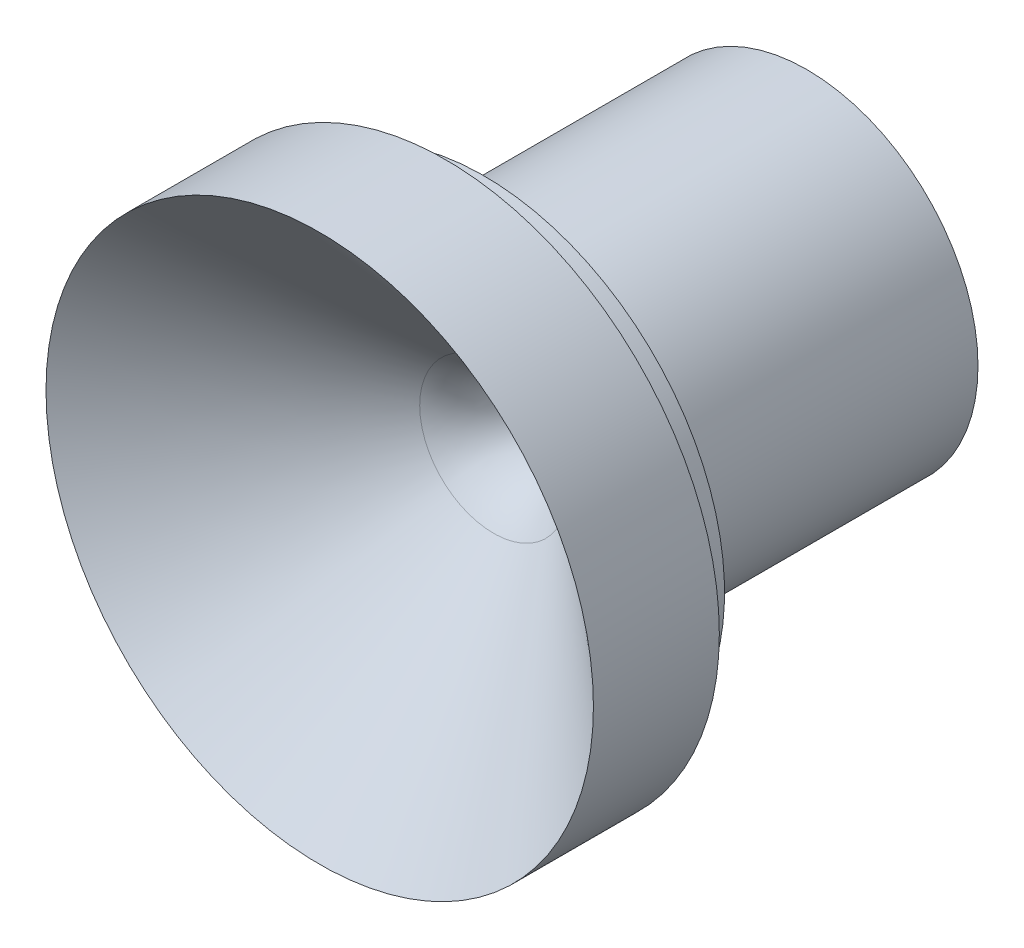
ISO-10303-21;
HEADER;
FILE_DESCRIPTION(('STEP AP214'),'2;1');
FILE_NAME('part.step','',(''),(''),'','','');
FILE_SCHEMA(('AUTOMOTIVE_DESIGN { 1 0 10303 214 1 1 1 1 }'));
ENDSEC;
DATA;
#1=APPLICATION_CONTEXT('core data for automotive mechanical design processes');
#2=APPLICATION_PROTOCOL_DEFINITION('international standard','automotive_design',2000,#1);
#3=PRODUCT_CONTEXT('',#1,'mechanical');
#4=PRODUCT('Part','Part','',(#3));
#5=PRODUCT_RELATED_PRODUCT_CATEGORY('part','',(#4));
#6=PRODUCT_DEFINITION_FORMATION('','',#4);
#7=PRODUCT_DEFINITION_CONTEXT('part definition',#1,'design');
#8=PRODUCT_DEFINITION('design','',#6,#7);
#9=PRODUCT_DEFINITION_SHAPE('','',#8);
#10=(LENGTH_UNIT() NAMED_UNIT(*) SI_UNIT(.MILLI.,.METRE.));
#11=(NAMED_UNIT(*) PLANE_ANGLE_UNIT() SI_UNIT($,.RADIAN.));
#12=(NAMED_UNIT(*) SI_UNIT($,.STERADIAN.) SOLID_ANGLE_UNIT());
#13=UNCERTAINTY_MEASURE_WITH_UNIT(LENGTH_MEASURE(1.E-05),#10,'distance_accuracy_value','');
#14=(GEOMETRIC_REPRESENTATION_CONTEXT(3) GLOBAL_UNCERTAINTY_ASSIGNED_CONTEXT((#13)) GLOBAL_UNIT_ASSIGNED_CONTEXT((#10,
#11,#12)) REPRESENTATION_CONTEXT('',''));
#15=CARTESIAN_POINT('',(0.,0.,0.));
#16=DIRECTION('',(0.,0.,1.));
#17=DIRECTION('',(1.,0.,0.));
#18=AXIS2_PLACEMENT_3D('',#15,#16,#17);
#19=CARTESIAN_POINT('',(0.,0.,0.));
#20=DIRECTION('',(0.,0.,-1.));
#21=DIRECTION('',(-1.,0.,0.));
#22=AXIS2_PLACEMENT_3D('',#19,#20,#21);
#23=TOROIDAL_SURFACE('',#22,6.5532,4.76250000000001);
#24=CARTESIAN_POINT('',(0.,0.,0.));
#25=DIRECTION('',(0.,0.,-1.));
#26=DIRECTION('',(-1.,0.,0.));
#27=AXIS2_PLACEMENT_3D('',#24,#25,#26);
#28=CIRCLE('',#27,1.7907);
#29=CARTESIAN_POINT('',(-1.7907,0.,0.));
#30=VERTEX_POINT('',#29);
#31=EDGE_CURVE('E10',#30,#30,#28,.T.);
#32=ORIENTED_EDGE('',*,*,#31,.T.);
#33=EDGE_LOOP('',(#32));
#34=FACE_BOUND('',#33,.T.);
#35=CARTESIAN_POINT('',(0.,0.,3.59315245126895));
#36=DIRECTION('',(0.,0.,-1.));
#37=DIRECTION('',(-1.,0.,0.));
#38=AXIS2_PLACEMENT_3D('',#35,#36,#37);
#39=CIRCLE('',#38,3.42739422997203);
#40=CARTESIAN_POINT('',(-3.42739422997203,0.,3.59315245126895));
#41=VERTEX_POINT('',#40);
#42=EDGE_CURVE('E74',#41,#41,#39,.T.);
#43=ORIENTED_EDGE('',*,*,#42,.F.);
#44=EDGE_LOOP('',(#43));
#45=FACE_BOUND('',#44,.T.);
#46=ADVANCED_FACE('F37',(#34,#45),#23,.T.);
#47=CARTESIAN_POINT('',(0.,0.,0.));
#48=DIRECTION('',(0.,0.,-1.));
#49=DIRECTION('',(-1.,0.,0.));
#50=AXIS2_PLACEMENT_3D('',#47,#48,#49);
#51=CYLINDRICAL_SURFACE('',#50,1.7907);
#52=CARTESIAN_POINT('',(0.,0.,-2.794));
#53=DIRECTION('',(0.,0.,-1.));
#54=DIRECTION('',(-1.,0.,0.));
#55=AXIS2_PLACEMENT_3D('',#52,#53,#54);
#56=CIRCLE('',#55,1.7907);
#57=CARTESIAN_POINT('',(-1.7907,0.,-2.794));
#58=VERTEX_POINT('',#57);
#59=EDGE_CURVE('E43',#58,#58,#56,.T.);
#60=ORIENTED_EDGE('',*,*,#59,.T.);
#61=EDGE_LOOP('',(#60));
#62=FACE_BOUND('',#61,.T.);
#63=ORIENTED_EDGE('',*,*,#31,.F.);
#64=EDGE_LOOP('',(#63));
#65=FACE_BOUND('',#64,.T.);
#66=ADVANCED_FACE('F82',(#62,#65),#51,.F.);
#67=CARTESIAN_POINT('',(0.,0.,-2.794));
#68=DIRECTION('',(0.,0.,-1.));
#69=DIRECTION('',(-1.,0.,0.));
#70=AXIS2_PLACEMENT_3D('',#67,#68,#69);
#71=CONICAL_SURFACE('',#70,1.7907,0.261799387799139);
#72=CARTESIAN_POINT('',(0.,0.,-10.9462917840538));
#73=DIRECTION('',(0.,0.,-1.));
#74=DIRECTION('',(-1.,0.,0.));
#75=AXIS2_PLACEMENT_3D('',#72,#73,#74);
#76=CIRCLE('',#75,3.9751);
#77=CARTESIAN_POINT('',(-3.9751,0.,-10.9462917840538));
#78=VERTEX_POINT('',#77);
#79=EDGE_CURVE('E47',#78,#78,#76,.T.);
#80=ORIENTED_EDGE('',*,*,#79,.T.);
#81=EDGE_LOOP('',(#80));
#82=FACE_BOUND('',#81,.T.);
#83=ORIENTED_EDGE('',*,*,#59,.F.);
#84=EDGE_LOOP('',(#83));
#85=FACE_BOUND('',#84,.T.);
#86=ADVANCED_FACE('F86',(#82,#85),#71,.F.);
#87=CARTESIAN_POINT('',(0.,3.9751,-10.9462917840538));
#88=DIRECTION('',(0.,0.,-1.));
#89=DIRECTION('',(-1.,0.,0.));
#90=AXIS2_PLACEMENT_3D('',#87,#88,#89);
#91=PLANE('',#90);
#92=CARTESIAN_POINT('',(0.,0.,-10.9462917840538));
#93=DIRECTION('',(0.,0.,-1.));
#94=DIRECTION('',(-1.,0.,0.));
#95=AXIS2_PLACEMENT_3D('',#92,#93,#94);
#96=CIRCLE('',#95,7.9375);
#97=CARTESIAN_POINT('',(-7.9375,0.,-10.9462917840538));
#98=VERTEX_POINT('',#97);
#99=EDGE_CURVE('E51',#98,#98,#96,.T.);
#100=ORIENTED_EDGE('',*,*,#99,.T.);
#101=EDGE_LOOP('',(#100));
#102=FACE_BOUND('',#101,.T.);
#103=ORIENTED_EDGE('',*,*,#79,.F.);
#104=EDGE_LOOP('',(#103));
#105=FACE_BOUND('',#104,.T.);
#106=ADVANCED_FACE('F90',(#102,#105),#91,.T.);
#107=CARTESIAN_POINT('',(0.,0.,0.));
#108=DIRECTION('',(0.,0.,-1.));
#109=DIRECTION('',(-1.,0.,0.));
#110=AXIS2_PLACEMENT_3D('',#107,#108,#109);
#111=CYLINDRICAL_SURFACE('',#110,7.9375);
#112=CARTESIAN_POINT('',(0.,0.,2.21090821594619));
#113=DIRECTION('',(0.,0.,-1.));
#114=DIRECTION('',(-1.,0.,0.));
#115=AXIS2_PLACEMENT_3D('',#112,#113,#114);
#116=CIRCLE('',#115,7.9375);
#117=CARTESIAN_POINT('',(-7.9375,0.,2.21090821594619));
#118=VERTEX_POINT('',#117);
#119=EDGE_CURVE('E56',#118,#118,#116,.T.);
#120=ORIENTED_EDGE('',*,*,#119,.T.);
#121=EDGE_LOOP('',(#120));
#122=FACE_BOUND('',#121,.T.);
#123=ORIENTED_EDGE('',*,*,#99,.F.);
#124=EDGE_LOOP('',(#123));
#125=FACE_BOUND('',#124,.T.);
#126=ADVANCED_FACE('F97',(#122,#125),#111,.T.);
#127=CARTESIAN_POINT('',(0.,0.,2.21090821594619));
#128=DIRECTION('',(0.,0.,1.));
#129=DIRECTION('',(1.,0.,0.));
#130=AXIS2_PLACEMENT_3D('',#127,#128,#129);
#131=CONICAL_SURFACE('',#130,7.9375,0.35868151455151);
#132=CARTESIAN_POINT('',(0.,0.,4.03970821594619));
#133=DIRECTION('',(0.,0.,-1.));
#134=DIRECTION('',(-1.,0.,0.));
#135=AXIS2_PLACEMENT_3D('',#132,#133,#134);
#136=CIRCLE('',#135,8.62311402961606);
#137=CARTESIAN_POINT('',(-8.62311402961606,0.,4.03970821594619));
#138=VERTEX_POINT('',#137);
#139=EDGE_CURVE('E59',#138,#138,#136,.T.);
#140=ORIENTED_EDGE('',*,*,#139,.T.);
#141=EDGE_LOOP('',(#140));
#142=FACE_BOUND('',#141,.T.);
#143=ORIENTED_EDGE('',*,*,#119,.F.);
#144=EDGE_LOOP('',(#143));
#145=FACE_BOUND('',#144,.T.);
#146=ADVANCED_FACE('F101',(#142,#145),#131,.T.);
#147=CARTESIAN_POINT('',(0.,8.62311402961606,4.03970821594619));
#148=DIRECTION('',(0.,0.,-1.));
#149=DIRECTION('',(-1.,0.,0.));
#150=AXIS2_PLACEMENT_3D('',#147,#148,#149);
#151=PLANE('',#150);
#152=CARTESIAN_POINT('',(0.,0.,4.03970821594619));
#153=DIRECTION('',(0.,0.,-1.));
#154=DIRECTION('',(-1.,0.,0.));
#155=AXIS2_PLACEMENT_3D('',#152,#153,#154);
#156=CIRCLE('',#155,11.1633);
#157=CARTESIAN_POINT('',(-11.1633,0.,4.03970821594619));
#158=VERTEX_POINT('',#157);
#159=EDGE_CURVE('E62',#158,#158,#156,.T.);
#160=ORIENTED_EDGE('',*,*,#159,.T.);
#161=EDGE_LOOP('',(#160));
#162=FACE_BOUND('',#161,.T.);
#163=ORIENTED_EDGE('',*,*,#139,.F.);
#164=EDGE_LOOP('',(#163));
#165=FACE_BOUND('',#164,.T.);
#166=ADVANCED_FACE('F105',(#162,#165),#151,.T.);
#167=CARTESIAN_POINT('',(0.,0.,0.));
#168=DIRECTION('',(0.,0.,-1.));
#169=DIRECTION('',(-1.,0.,0.));
#170=AXIS2_PLACEMENT_3D('',#167,#168,#169);
#171=CYLINDRICAL_SURFACE('',#170,11.1633);
#172=CARTESIAN_POINT('',(0.,0.,5.81770821594619));
#173=DIRECTION('',(0.,0.,-1.));
#174=DIRECTION('',(-1.,0.,0.));
#175=AXIS2_PLACEMENT_3D('',#172,#173,#174);
#176=CIRCLE('',#175,11.1633);
#177=CARTESIAN_POINT('',(-11.1633,0.,5.81770821594619));
#178=VERTEX_POINT('',#177);
#179=EDGE_CURVE('E65',#178,#178,#176,.T.);
#180=ORIENTED_EDGE('',*,*,#179,.T.);
#181=EDGE_LOOP('',(#180));
#182=FACE_BOUND('',#181,.T.);
#183=ORIENTED_EDGE('',*,*,#159,.F.);
#184=EDGE_LOOP('',(#183));
#185=FACE_BOUND('',#184,.T.);
#186=ADVANCED_FACE('F109',(#182,#185),#171,.T.);
#187=CARTESIAN_POINT('',(0.,11.1633,5.81770821594619));
#188=DIRECTION('',(0.,0.,-1.));
#189=DIRECTION('',(-1.,0.,0.));
#190=AXIS2_PLACEMENT_3D('',#187,#188,#189);
#191=PLANE('',#190);
#192=CARTESIAN_POINT('',(0.,0.,5.81770821594619));
#193=DIRECTION('',(0.,0.,-1.));
#194=DIRECTION('',(-1.,0.,0.));
#195=AXIS2_PLACEMENT_3D('',#192,#193,#194);
#196=CIRCLE('',#195,12.7);
#197=CARTESIAN_POINT('',(-12.7,0.,5.81770821594619));
#198=VERTEX_POINT('',#197);
#199=EDGE_CURVE('E68',#198,#198,#196,.T.);
#200=ORIENTED_EDGE('',*,*,#199,.T.);
#201=EDGE_LOOP('',(#200));
#202=FACE_BOUND('',#201,.T.);
#203=ORIENTED_EDGE('',*,*,#179,.F.);
#204=EDGE_LOOP('',(#203));
#205=FACE_BOUND('',#204,.T.);
#206=ADVANCED_FACE('F113',(#202,#205),#191,.T.);
#207=CARTESIAN_POINT('',(0.,0.,0.));
#208=DIRECTION('',(0.,0.,-1.));
#209=DIRECTION('',(-1.,0.,0.));
#210=AXIS2_PLACEMENT_3D('',#207,#208,#209);
#211=CYLINDRICAL_SURFACE('',#210,12.7);
#212=CARTESIAN_POINT('',(0.,0.,11.6597082159462));
#213=DIRECTION('',(0.,0.,-1.));
#214=DIRECTION('',(-1.,0.,0.));
#215=AXIS2_PLACEMENT_3D('',#212,#213,#214);
#216=CIRCLE('',#215,12.7);
#217=CARTESIAN_POINT('',(-12.7,0.,11.6597082159462));
#218=VERTEX_POINT('',#217);
#219=EDGE_CURVE('E71',#218,#218,#216,.T.);
#220=ORIENTED_EDGE('',*,*,#219,.T.);
#221=EDGE_LOOP('',(#220));
#222=FACE_BOUND('',#221,.T.);
#223=ORIENTED_EDGE('',*,*,#199,.F.);
#224=EDGE_LOOP('',(#223));
#225=FACE_BOUND('',#224,.T.);
#226=ADVANCED_FACE('F117',(#222,#225),#211,.T.);
#227=CARTESIAN_POINT('',(0.,0.,11.6597082159462));
#228=DIRECTION('',(0.,0.,1.));
#229=DIRECTION('',(1.,0.,0.));
#230=AXIS2_PLACEMENT_3D('',#227,#228,#229);
#231=CONICAL_SURFACE('',#230,12.7,0.854842734547861);
#232=ORIENTED_EDGE('',*,*,#42,.T.);
#233=EDGE_LOOP('',(#232));
#234=FACE_BOUND('',#233,.T.);
#235=ORIENTED_EDGE('',*,*,#219,.F.);
#236=EDGE_LOOP('',(#235));
#237=FACE_BOUND('',#236,.T.);
#238=ADVANCED_FACE('F78',(#234,#237),#231,.F.);
#239=CLOSED_SHELL('',(#46,#66,#86,#106,#126,#146,#166,#186,#206,#226,#238));
#240=MANIFOLD_SOLID_BREP('B2',#239);
#241=ADVANCED_BREP_SHAPE_REPRESENTATION('',(#18,#240),#14);
#242=SHAPE_DEFINITION_REPRESENTATION(#9,#241);
ENDSEC;
END-ISO-10303-21;
